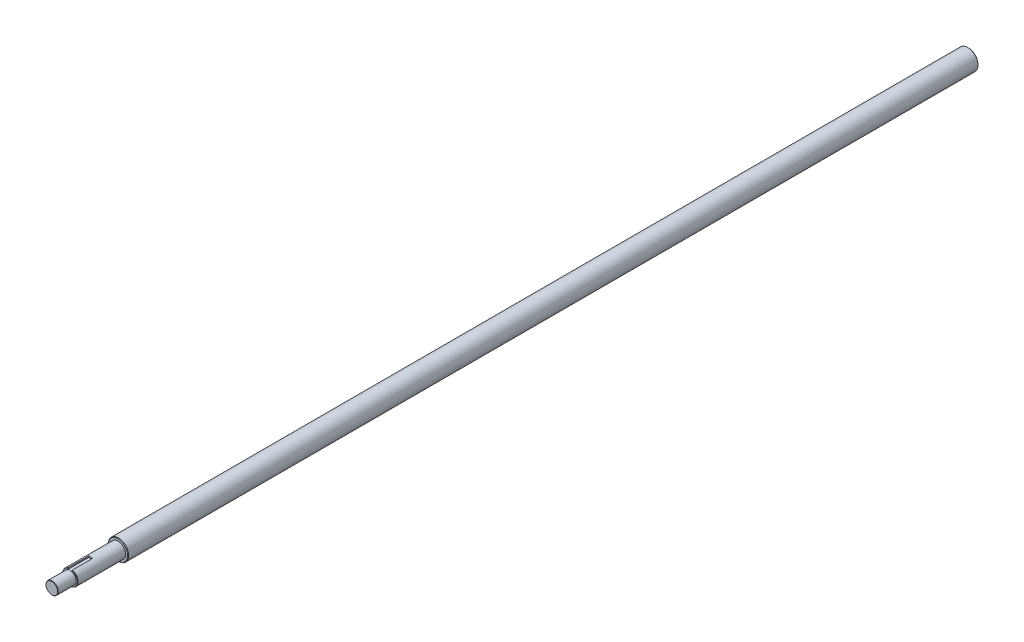
ISO-10303-21;
HEADER;
FILE_DESCRIPTION(('STEP AP214'),'2;1');
FILE_NAME('part.step','',(''),(''),'','','');
FILE_SCHEMA(('AUTOMOTIVE_DESIGN { 1 0 10303 214 1 1 1 1 }'));
ENDSEC;
DATA;
#1=APPLICATION_CONTEXT('core data for automotive mechanical design processes');
#2=APPLICATION_PROTOCOL_DEFINITION('international standard','automotive_design',2000,#1);
#3=PRODUCT_CONTEXT('',#1,'mechanical');
#4=PRODUCT('Part','Part','',(#3));
#5=PRODUCT_RELATED_PRODUCT_CATEGORY('part','',(#4));
#6=PRODUCT_DEFINITION_FORMATION('','',#4);
#7=PRODUCT_DEFINITION_CONTEXT('part definition',#1,'design');
#8=PRODUCT_DEFINITION('design','',#6,#7);
#9=PRODUCT_DEFINITION_SHAPE('','',#8);
#10=(LENGTH_UNIT() NAMED_UNIT(*) SI_UNIT(.MILLI.,.METRE.));
#11=(NAMED_UNIT(*) PLANE_ANGLE_UNIT() SI_UNIT($,.RADIAN.));
#12=(NAMED_UNIT(*) SI_UNIT($,.STERADIAN.) SOLID_ANGLE_UNIT());
#13=UNCERTAINTY_MEASURE_WITH_UNIT(LENGTH_MEASURE(1.E-05),#10,'distance_accuracy_value','');
#14=(GEOMETRIC_REPRESENTATION_CONTEXT(3) GLOBAL_UNCERTAINTY_ASSIGNED_CONTEXT((#13)) GLOBAL_UNIT_ASSIGNED_CONTEXT((#10,
#11,#12)) REPRESENTATION_CONTEXT('',''));
#15=CARTESIAN_POINT('',(0.,0.,0.));
#16=DIRECTION('',(0.,0.,1.));
#17=DIRECTION('',(1.,0.,0.));
#18=AXIS2_PLACEMENT_3D('',#15,#16,#17);
#19=CARTESIAN_POINT('',(0.,0.,835.));
#20=DIRECTION('',(0.,0.,1.));
#21=DIRECTION('',(1.,0.,0.));
#22=AXIS2_PLACEMENT_3D('',#19,#20,#21);
#23=CYLINDRICAL_SURFACE('',#22,7.5);
#24=DIRECTION('',(0.,0.,1.));
#25=VECTOR('',#24,1.);
#26=CARTESIAN_POINT('',(-2.,7.22841614740048,835.));
#27=LINE('',#26,#25);
#28=CARTESIAN_POINT('',(-2.,7.22841614740048,862.));
#29=VERTEX_POINT('',#28);
#30=CARTESIAN_POINT('',(-2.,7.22841614740048,881.7));
#31=VERTEX_POINT('',#30);
#32=EDGE_CURVE('E72',#29,#31,#27,.T.);
#33=ORIENTED_EDGE('',*,*,#32,.F.);
#34=CARTESIAN_POINT('',(0.,0.,862.));
#35=DIRECTION('',(0.,0.,1.));
#36=DIRECTION('',(1.,0.,0.));
#37=AXIS2_PLACEMENT_3D('',#34,#35,#36);
#38=CIRCLE('',#37,7.5);
#39=CARTESIAN_POINT('',(2.,7.22841614740048,862.));
#40=VERTEX_POINT('',#39);
#41=EDGE_CURVE('E11',#29,#40,#38,.F.);
#42=ORIENTED_EDGE('',*,*,#41,.T.);
#43=DIRECTION('',(0.,0.,1.));
#44=VECTOR('',#43,1.);
#45=CARTESIAN_POINT('',(2.,7.22841614740048,835.));
#46=LINE('',#45,#44);
#47=CARTESIAN_POINT('',(2.,7.22841614740048,881.7));
#48=VERTEX_POINT('',#47);
#49=EDGE_CURVE('E122',#48,#40,#46,.F.);
#50=ORIENTED_EDGE('',*,*,#49,.F.);
#51=CARTESIAN_POINT('',(0.,0.,881.7));
#52=DIRECTION('',(0.,0.,1.));
#53=DIRECTION('',(1.,0.,0.));
#54=AXIS2_PLACEMENT_3D('',#51,#52,#53);
#55=CIRCLE('',#54,7.5);
#56=EDGE_CURVE('E157',#48,#31,#55,.F.);
#57=ORIENTED_EDGE('',*,*,#56,.T.);
#58=EDGE_LOOP('',(#33,#42,#50,#57));
#59=FACE_BOUND('',#58,.T.);
#60=CARTESIAN_POINT('',(0.,0.,835.));
#61=DIRECTION('',(0.,0.,1.));
#62=DIRECTION('',(1.,0.,0.));
#63=AXIS2_PLACEMENT_3D('',#60,#61,#62);
#64=CIRCLE('',#63,7.5);
#65=CARTESIAN_POINT('',(7.5,0.,835.));
#66=VERTEX_POINT('',#65);
#67=EDGE_CURVE('E145',#66,#66,#64,.T.);
#68=ORIENTED_EDGE('',*,*,#67,.T.);
#69=EDGE_LOOP('',(#68));
#70=FACE_BOUND('',#69,.T.);
#71=ADVANCED_FACE('F47',(#59,#70),#23,.T.);
#72=CARTESIAN_POINT('',(0.,0.,900.));
#73=DIRECTION('',(0.,0.,-1.));
#74=DIRECTION('',(-1.,0.,0.));
#75=AXIS2_PLACEMENT_3D('',#72,#73,#74);
#76=CYLINDRICAL_SURFACE('',#75,10.);
#77=CARTESIAN_POINT('',(0.,0.,0.500000000000167));
#78=DIRECTION('',(0.,0.,1.));
#79=DIRECTION('',(1.,0.,0.));
#80=AXIS2_PLACEMENT_3D('',#77,#78,#79);
#81=CIRCLE('',#80,10.);
#82=CARTESIAN_POINT('',(10.,0.,0.500000000000167));
#83=VERTEX_POINT('',#82);
#84=EDGE_CURVE('E173',#83,#83,#81,.T.);
#85=ORIENTED_EDGE('',*,*,#84,.T.);
#86=EDGE_LOOP('',(#85));
#87=FACE_BOUND('',#86,.T.);
#88=CARTESIAN_POINT('',(0.,0.,834.5));
#89=DIRECTION('',(0.,0.,1.));
#90=DIRECTION('',(1.,0.,0.));
#91=AXIS2_PLACEMENT_3D('',#88,#89,#90);
#92=CIRCLE('',#91,10.);
#93=CARTESIAN_POINT('',(10.,0.,834.5));
#94=VERTEX_POINT('',#93);
#95=EDGE_CURVE('E153',#94,#94,#92,.F.);
#96=ORIENTED_EDGE('',*,*,#95,.T.);
#97=EDGE_LOOP('',(#96));
#98=FACE_BOUND('',#97,.T.);
#99=ADVANCED_FACE('F218',(#87,#98),#76,.T.);
#100=CARTESIAN_POINT('',(0.,0.,0.));
#101=DIRECTION('',(0.,0.,1.));
#102=DIRECTION('',(1.,0.,0.));
#103=AXIS2_PLACEMENT_3D('',#100,#101,#102);
#104=PLANE('',#103);
#105=CARTESIAN_POINT('',(0.,0.,0.));
#106=DIRECTION('',(0.,0.,1.));
#107=DIRECTION('',(1.,0.,0.));
#108=AXIS2_PLACEMENT_3D('',#105,#106,#107);
#109=CIRCLE('',#108,9.49999999999995);
#110=CARTESIAN_POINT('',(9.49999999999995,0.,0.));
#111=VERTEX_POINT('',#110);
#112=EDGE_CURVE('E177',#111,#111,#109,.F.);
#113=ORIENTED_EDGE('',*,*,#112,.T.);
#114=EDGE_LOOP('',(#113));
#115=FACE_BOUND('',#114,.T.);
#116=ADVANCED_FACE('F222',(#115),#104,.F.);
#117=CARTESIAN_POINT('',(0.,0.,835.));
#118=DIRECTION('',(0.,0.,1.));
#119=DIRECTION('',(1.,0.,0.));
#120=AXIS2_PLACEMENT_3D('',#117,#118,#119);
#121=PLANE('',#120);
#122=CARTESIAN_POINT('',(0.,0.,835.));
#123=DIRECTION('',(0.,0.,1.));
#124=DIRECTION('',(1.,0.,0.));
#125=AXIS2_PLACEMENT_3D('',#122,#123,#124);
#126=CIRCLE('',#125,9.49999999999995);
#127=CARTESIAN_POINT('',(9.49999999999995,0.,835.));
#128=VERTEX_POINT('',#127);
#129=EDGE_CURVE('E149',#128,#128,#126,.T.);
#130=ORIENTED_EDGE('',*,*,#129,.T.);
#131=EDGE_LOOP('',(#130));
#132=FACE_BOUND('',#131,.T.);
#133=ORIENTED_EDGE('',*,*,#67,.F.);
#134=EDGE_LOOP('',(#133));
#135=FACE_BOUND('',#134,.T.);
#136=ADVANCED_FACE('F214',(#132,#135),#121,.T.);
#137=CARTESIAN_POINT('',(0.,0.,882.));
#138=DIRECTION('',(0.,0.,1.));
#139=DIRECTION('',(1.,0.,0.));
#140=AXIS2_PLACEMENT_3D('',#137,#138,#139);
#141=PLANE('',#140);
#142=DIRECTION('',(0.,-1.,0.));
#143=VECTOR('',#142,1.);
#144=CARTESIAN_POINT('',(-2.,8.05802244651467,882.));
#145=LINE('',#144,#143);
#146=CARTESIAN_POINT('',(-2.,6.91664658631622,882.));
#147=VERTEX_POINT('',#146);
#148=CARTESIAN_POINT('',(-2.,6.,882.));
#149=VERTEX_POINT('',#148);
#150=EDGE_CURVE('E111',#147,#149,#145,.T.);
#151=ORIENTED_EDGE('',*,*,#150,.F.);
#152=CARTESIAN_POINT('',(0.,0.,882.));
#153=DIRECTION('',(0.,0.,1.));
#154=DIRECTION('',(1.,0.,0.));
#155=AXIS2_PLACEMENT_3D('',#152,#153,#154);
#156=CIRCLE('',#155,7.19999999999998);
#157=CARTESIAN_POINT('',(2.,6.91664658631622,882.));
#158=VERTEX_POINT('',#157);
#159=EDGE_CURVE('E161',#147,#158,#156,.T.);
#160=ORIENTED_EDGE('',*,*,#159,.T.);
#161=DIRECTION('',(0.,1.,0.));
#162=VECTOR('',#161,1.);
#163=CARTESIAN_POINT('',(2.,6.,882.));
#164=LINE('',#163,#162);
#165=CARTESIAN_POINT('',(2.,6.,882.));
#166=VERTEX_POINT('',#165);
#167=EDGE_CURVE('E64',#166,#158,#164,.T.);
#168=ORIENTED_EDGE('',*,*,#167,.F.);
#169=DIRECTION('',(1.,0.,0.));
#170=VECTOR('',#169,1.);
#171=CARTESIAN_POINT('',(0.,6.,882.));
#172=LINE('',#171,#170);
#173=CARTESIAN_POINT('',(0.,6.,882.));
#174=VERTEX_POINT('',#173);
#175=EDGE_CURVE('E116',#174,#166,#172,.T.);
#176=ORIENTED_EDGE('',*,*,#175,.F.);
#177=CARTESIAN_POINT('',(0.,0.,882.));
#178=DIRECTION('',(0.,0.,1.));
#179=DIRECTION('',(1.,0.,0.));
#180=AXIS2_PLACEMENT_3D('',#177,#178,#179);
#181=CIRCLE('',#180,6.);
#182=EDGE_CURVE('E141',#174,#174,#181,.T.);
#183=ORIENTED_EDGE('',*,*,#182,.F.);
#184=EDGE_CURVE('E128',#149,#174,#172,.T.);
#185=ORIENTED_EDGE('',*,*,#184,.F.);
#186=EDGE_LOOP('',(#151,#160,#168,#176,#183,#185));
#187=FACE_BOUND('',#186,.T.);
#188=ADVANCED_FACE('F210',(#187),#141,.T.);
#189=CARTESIAN_POINT('',(0.,0.,882.));
#190=DIRECTION('',(0.,0.,1.));
#191=DIRECTION('',(1.,0.,0.));
#192=AXIS2_PLACEMENT_3D('',#189,#190,#191);
#193=CYLINDRICAL_SURFACE('',#192,6.);
#194=CARTESIAN_POINT('',(0.,0.,899.7));
#195=DIRECTION('',(0.,0.,1.));
#196=DIRECTION('',(1.,0.,0.));
#197=AXIS2_PLACEMENT_3D('',#194,#195,#196);
#198=CIRCLE('',#197,6.);
#199=CARTESIAN_POINT('',(6.,0.,899.7));
#200=VERTEX_POINT('',#199);
#201=EDGE_CURVE('E169',#200,#200,#198,.F.);
#202=ORIENTED_EDGE('',*,*,#201,.T.);
#203=EDGE_LOOP('',(#202));
#204=FACE_BOUND('',#203,.T.);
#205=ORIENTED_EDGE('',*,*,#182,.T.);
#206=EDGE_LOOP('',(#205));
#207=FACE_BOUND('',#206,.T.);
#208=ADVANCED_FACE('F206',(#204,#207),#193,.T.);
#209=CARTESIAN_POINT('',(0.,0.,900.));
#210=DIRECTION('',(0.,0.,1.));
#211=DIRECTION('',(1.,0.,0.));
#212=AXIS2_PLACEMENT_3D('',#209,#210,#211);
#213=PLANE('',#212);
#214=CARTESIAN_POINT('',(0.,0.,900.));
#215=DIRECTION('',(0.,0.,1.));
#216=DIRECTION('',(1.,0.,0.));
#217=AXIS2_PLACEMENT_3D('',#214,#215,#216);
#218=CIRCLE('',#217,5.70000000000004);
#219=CARTESIAN_POINT('',(5.70000000000004,0.,900.));
#220=VERTEX_POINT('',#219);
#221=EDGE_CURVE('E165',#220,#220,#218,.T.);
#222=ORIENTED_EDGE('',*,*,#221,.T.);
#223=EDGE_LOOP('',(#222));
#224=FACE_BOUND('',#223,.T.);
#225=ADVANCED_FACE('F209',(#224),#213,.T.);
#226=CARTESIAN_POINT('',(0.,0.,835.));
#227=DIRECTION('',(0.,0.,-1.));
#228=DIRECTION('',(-1.,0.,0.));
#229=AXIS2_PLACEMENT_3D('',#226,#227,#228);
#230=CONICAL_SURFACE('',#229,9.49999999999995,0.78539816339744);
#231=ORIENTED_EDGE('',*,*,#95,.F.);
#232=EDGE_LOOP('',(#231));
#233=FACE_BOUND('',#232,.T.);
#234=ORIENTED_EDGE('',*,*,#129,.F.);
#235=EDGE_LOOP('',(#234));
#236=FACE_BOUND('',#235,.T.);
#237=ADVANCED_FACE('F226',(#233,#236),#230,.T.);
#238=CARTESIAN_POINT('',(0.,0.,881.7));
#239=DIRECTION('',(0.,0.,-1.));
#240=DIRECTION('',(-1.,0.,0.));
#241=AXIS2_PLACEMENT_3D('',#238,#239,#240);
#242=CONICAL_SURFACE('',#241,7.5,0.785398163397531);
#243=CARTESIAN_POINT('',(-2.,8.8056345446262,880.170094145922));
#244=CARTESIAN_POINT('',(-2.,8.51615131409588,880.452344319933));
#245=CARTESIAN_POINT('',(-2.,8.22636697362639,880.734287570595));
#246=CARTESIAN_POINT('',(-2.,7.64587320722793,881.297205827758));
#247=CARTESIAN_POINT('',(-2.,7.35516380359838,881.578180857265));
#248=CARTESIAN_POINT('',(-2.,6.77247885736111,882.138826016128));
#249=CARTESIAN_POINT('',(-2.,6.48050329583928,882.418496125861));
#250=CARTESIAN_POINT('',(-2.,6.04115195827189,882.836550129579));
#251=CARTESIAN_POINT('',(-2.,5.89446842281207,882.975661253857));
#252=CARTESIAN_POINT('',(-2.,5.60052346042717,883.253273123294));
#253=CARTESIAN_POINT('',(-2.,5.45326203019977,883.391773864955));
#254=CARTESIAN_POINT('',(-2.,5.30565430683316,883.529905854078));
#255=B_SPLINE_CURVE_WITH_KNOTS('',3,(#243,#244,#245,#246,#247,#248,#249,#250,#251,#252,#253,
#254),.UNSPECIFIED.,.F.,.F.,(4,2,2,2,2,4),(0.,1.21292842331966,2.4258278262041,3.63874541045505,
4.24521866367602,4.85169538759546),.UNSPECIFIED.);
#256=EDGE_CURVE('E57',#31,#147,#255,.T.);
#257=ORIENTED_EDGE('',*,*,#256,.F.);
#258=ORIENTED_EDGE('',*,*,#56,.F.);
#259=CARTESIAN_POINT('',(2.,5.30565430683318,883.529905854078));
#260=CARTESIAN_POINT('',(2.,5.45326203019978,883.391773864955));
#261=CARTESIAN_POINT('',(2.,5.60052346042718,883.253273123294));
#262=CARTESIAN_POINT('',(2.,5.89446842281207,882.975661253857));
#263=CARTESIAN_POINT('',(2.,6.0411519582719,882.836550129579));
#264=CARTESIAN_POINT('',(2.,6.48050329583928,882.418496125861));
#265=CARTESIAN_POINT('',(2.,6.77247885736111,882.138826016128));
#266=CARTESIAN_POINT('',(2.,7.35516380359835,881.578180857265));
#267=CARTESIAN_POINT('',(2.,7.64587320722788,881.297205827758));
#268=CARTESIAN_POINT('',(2.,8.22636697362635,880.734287570595));
#269=CARTESIAN_POINT('',(2.,8.51615131409587,880.452344319933));
#270=CARTESIAN_POINT('',(2.,8.80563454462621,880.170094145922));
#271=B_SPLINE_CURVE_WITH_KNOTS('',3,(#259,#260,#261,#262,#263,#264,#265,#266,#267,#268,#269,
#270),.UNSPECIFIED.,.F.,.F.,(4,2,2,2,2,4),(0.,0.606476723919433,1.21294997714039,
2.42586756139135,3.63876696427565,4.85169538759546),.UNSPECIFIED.);
#272=EDGE_CURVE('E181',#158,#48,#271,.T.);
#273=ORIENTED_EDGE('',*,*,#272,.F.);
#274=ORIENTED_EDGE('',*,*,#159,.F.);
#275=EDGE_LOOP('',(#257,#258,#273,#274));
#276=FACE_BOUND('',#275,.T.);
#277=ADVANCED_FACE('F195',(#276),#242,.T.);
#278=CARTESIAN_POINT('',(0.,0.,900.));
#279=DIRECTION('',(0.,0.,-1.));
#280=DIRECTION('',(-1.,0.,0.));
#281=AXIS2_PLACEMENT_3D('',#278,#279,#280);
#282=CONICAL_SURFACE('',#281,5.70000000000004,0.785398163397441);
#283=ORIENTED_EDGE('',*,*,#201,.F.);
#284=EDGE_LOOP('',(#283));
#285=FACE_BOUND('',#284,.T.);
#286=ORIENTED_EDGE('',*,*,#221,.F.);
#287=EDGE_LOOP('',(#286));
#288=FACE_BOUND('',#287,.T.);
#289=ADVANCED_FACE('F241',(#285,#288),#282,.T.);
#290=CARTESIAN_POINT('',(0.,0.,0.500000000000167));
#291=DIRECTION('',(0.,0.,1.));
#292=DIRECTION('',(1.,0.,0.));
#293=AXIS2_PLACEMENT_3D('',#290,#291,#292);
#294=CONICAL_SURFACE('',#293,10.,0.785398163397329);
#295=ORIENTED_EDGE('',*,*,#112,.F.);
#296=EDGE_LOOP('',(#295));
#297=FACE_BOUND('',#296,.T.);
#298=ORIENTED_EDGE('',*,*,#84,.F.);
#299=EDGE_LOOP('',(#298));
#300=FACE_BOUND('',#299,.T.);
#301=ADVANCED_FACE('F50',(#297,#300),#294,.T.);
#302=CARTESIAN_POINT('',(-2.,8.05802244651467,862.));
#303=DIRECTION('',(-1.,0.,0.));
#304=DIRECTION('',(0.,0.,1.));
#305=AXIS2_PLACEMENT_3D('',#302,#303,#304);
#306=PLANE('',#305);
#307=ORIENTED_EDGE('',*,*,#32,.T.);
#308=ORIENTED_EDGE('',*,*,#256,.T.);
#309=ORIENTED_EDGE('',*,*,#150,.T.);
#310=DIRECTION('',(0.,0.,1.));
#311=VECTOR('',#310,1.);
#312=CARTESIAN_POINT('',(-2.,6.,862.));
#313=LINE('',#312,#311);
#314=CARTESIAN_POINT('',(-2.,6.,862.));
#315=VERTEX_POINT('',#314);
#316=EDGE_CURVE('E118',#315,#149,#313,.T.);
#317=ORIENTED_EDGE('',*,*,#316,.F.);
#318=DIRECTION('',(0.,-1.,0.));
#319=VECTOR('',#318,1.);
#320=CARTESIAN_POINT('',(-2.,8.05802244651467,862.));
#321=LINE('',#320,#319);
#322=EDGE_CURVE('E106',#29,#315,#321,.T.);
#323=ORIENTED_EDGE('',*,*,#322,.F.);
#324=EDGE_LOOP('',(#307,#308,#309,#317,#323));
#325=FACE_BOUND('',#324,.T.);
#326=ADVANCED_FACE('F201',(#325),#306,.F.);
#327=CARTESIAN_POINT('',(2.,6.,862.));
#328=DIRECTION('',(1.,0.,0.));
#329=DIRECTION('',(0.,0.,-1.));
#330=AXIS2_PLACEMENT_3D('',#327,#328,#329);
#331=PLANE('',#330);
#332=ORIENTED_EDGE('',*,*,#49,.T.);
#333=DIRECTION('',(0.,1.,0.));
#334=VECTOR('',#333,1.);
#335=CARTESIAN_POINT('',(2.,6.,862.));
#336=LINE('',#335,#334);
#337=CARTESIAN_POINT('',(2.,6.,862.));
#338=VERTEX_POINT('',#337);
#339=EDGE_CURVE('E105',#338,#40,#336,.T.);
#340=ORIENTED_EDGE('',*,*,#339,.F.);
#341=DIRECTION('',(0.,0.,1.));
#342=VECTOR('',#341,1.);
#343=CARTESIAN_POINT('',(2.,6.,862.));
#344=LINE('',#343,#342);
#345=EDGE_CURVE('E113',#338,#166,#344,.T.);
#346=ORIENTED_EDGE('',*,*,#345,.T.);
#347=ORIENTED_EDGE('',*,*,#167,.T.);
#348=ORIENTED_EDGE('',*,*,#272,.T.);
#349=EDGE_LOOP('',(#332,#340,#346,#347,#348));
#350=FACE_BOUND('',#349,.T.);
#351=ADVANCED_FACE('F120',(#350),#331,.F.);
#352=CARTESIAN_POINT('',(0.,6.,862.));
#353=DIRECTION('',(0.,-1.,0.));
#354=DIRECTION('',(0.,0.,-1.));
#355=AXIS2_PLACEMENT_3D('',#352,#353,#354);
#356=PLANE('',#355);
#357=ORIENTED_EDGE('',*,*,#184,.T.);
#358=ORIENTED_EDGE('',*,*,#175,.T.);
#359=ORIENTED_EDGE('',*,*,#345,.F.);
#360=DIRECTION('',(1.,0.,0.));
#361=VECTOR('',#360,1.);
#362=CARTESIAN_POINT('',(-2.,6.,862.));
#363=LINE('',#362,#361);
#364=EDGE_CURVE('E101',#315,#338,#363,.T.);
#365=ORIENTED_EDGE('',*,*,#364,.F.);
#366=ORIENTED_EDGE('',*,*,#316,.T.);
#367=EDGE_LOOP('',(#357,#358,#359,#365,#366));
#368=FACE_BOUND('',#367,.T.);
#369=ADVANCED_FACE('F114',(#368),#356,.F.);
#370=CARTESIAN_POINT('',(0.,0.,862.));
#371=DIRECTION('',(0.,0.,1.));
#372=DIRECTION('',(1.,0.,0.));
#373=AXIS2_PLACEMENT_3D('',#370,#371,#372);
#374=PLANE('',#373);
#375=ORIENTED_EDGE('',*,*,#322,.T.);
#376=ORIENTED_EDGE('',*,*,#364,.T.);
#377=ORIENTED_EDGE('',*,*,#339,.T.);
#378=ORIENTED_EDGE('',*,*,#41,.F.);
#379=EDGE_LOOP('',(#375,#376,#377,#378));
#380=FACE_BOUND('',#379,.T.);
#381=ADVANCED_FACE('F103',(#380),#374,.T.);
#382=CLOSED_SHELL('',(#71,#99,#116,#136,#188,#208,#225,#237,#277,#289,#301,#326,#351,#369,#381));
#383=MANIFOLD_SOLID_BREP('B2',#382);
#384=ADVANCED_BREP_SHAPE_REPRESENTATION('',(#18,#383),#14);
#385=SHAPE_DEFINITION_REPRESENTATION(#9,#384);
ENDSEC;
END-ISO-10303-21;
